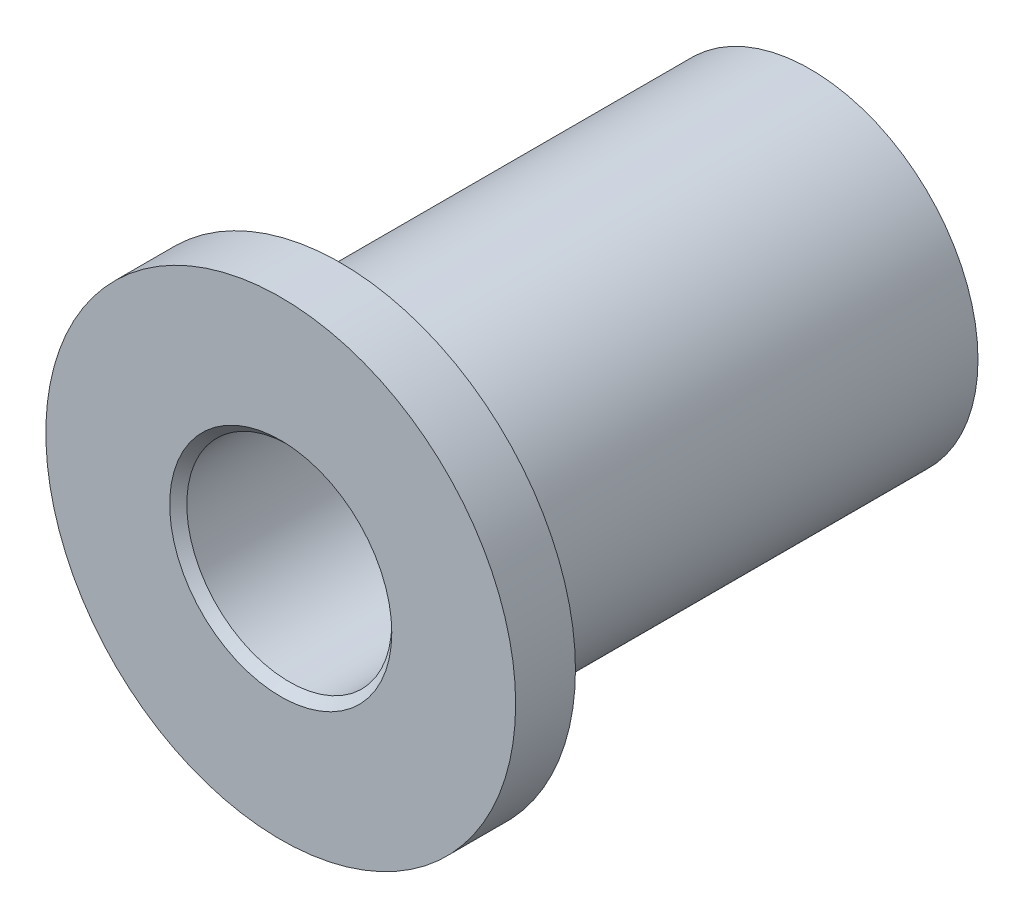
ISO-10303-21;
HEADER;
FILE_DESCRIPTION(('STEP AP214'),'2;1');
FILE_NAME('part.step','',(''),(''),'','','');
FILE_SCHEMA(('AUTOMOTIVE_DESIGN { 1 0 10303 214 1 1 1 1 }'));
ENDSEC;
DATA;
#1=APPLICATION_CONTEXT('core data for automotive mechanical design processes');
#2=APPLICATION_PROTOCOL_DEFINITION('international standard','automotive_design',2000,#1);
#3=PRODUCT_CONTEXT('',#1,'mechanical');
#4=PRODUCT('Part','Part','',(#3));
#5=PRODUCT_RELATED_PRODUCT_CATEGORY('part','',(#4));
#6=PRODUCT_DEFINITION_FORMATION('','',#4);
#7=PRODUCT_DEFINITION_CONTEXT('part definition',#1,'design');
#8=PRODUCT_DEFINITION('design','',#6,#7);
#9=PRODUCT_DEFINITION_SHAPE('','',#8);
#10=(LENGTH_UNIT() NAMED_UNIT(*) SI_UNIT(.MILLI.,.METRE.));
#11=(NAMED_UNIT(*) PLANE_ANGLE_UNIT() SI_UNIT($,.RADIAN.));
#12=(NAMED_UNIT(*) SI_UNIT($,.STERADIAN.) SOLID_ANGLE_UNIT());
#13=UNCERTAINTY_MEASURE_WITH_UNIT(LENGTH_MEASURE(1.E-05),#10,'distance_accuracy_value','');
#14=(GEOMETRIC_REPRESENTATION_CONTEXT(3) GLOBAL_UNCERTAINTY_ASSIGNED_CONTEXT((#13)) GLOBAL_UNIT_ASSIGNED_CONTEXT((#10,
#11,#12)) REPRESENTATION_CONTEXT('',''));
#15=CARTESIAN_POINT('',(0.,0.,0.));
#16=DIRECTION('',(0.,0.,1.));
#17=DIRECTION('',(1.,0.,0.));
#18=AXIS2_PLACEMENT_3D('',#15,#16,#17);
#19=CARTESIAN_POINT('',(0.,0.,-1.4));
#20=DIRECTION('',(0.,0.,1.));
#21=DIRECTION('',(1.,0.,0.));
#22=AXIS2_PLACEMENT_3D('',#19,#20,#21);
#23=PLANE('',#22);
#24=CARTESIAN_POINT('',(0.,0.,-1.4));
#25=DIRECTION('',(0.,0.,1.));
#26=DIRECTION('',(1.,0.,0.));
#27=AXIS2_PLACEMENT_3D('',#24,#25,#26);
#28=CIRCLE('',#27,5.5);
#29=CARTESIAN_POINT('',(5.5,0.,-1.4));
#30=VERTEX_POINT('',#29);
#31=EDGE_CURVE('E47',#30,#30,#28,.T.);
#32=ORIENTED_EDGE('',*,*,#31,.F.);
#33=EDGE_LOOP('',(#32));
#34=FACE_BOUND('',#33,.T.);
#35=CARTESIAN_POINT('',(0.,0.,-1.4));
#36=DIRECTION('',(0.,0.,1.));
#37=DIRECTION('',(1.,0.,0.));
#38=AXIS2_PLACEMENT_3D('',#35,#36,#37);
#39=CIRCLE('',#38,3.925);
#40=CARTESIAN_POINT('',(3.925,0.,-1.4));
#41=VERTEX_POINT('',#40);
#42=EDGE_CURVE('E43',#41,#41,#39,.F.);
#43=ORIENTED_EDGE('',*,*,#42,.F.);
#44=EDGE_LOOP('',(#43));
#45=FACE_BOUND('',#44,.T.);
#46=ADVANCED_FACE('F32',(#34,#45),#23,.F.);
#47=CARTESIAN_POINT('',(0.,0.,-1.4));
#48=DIRECTION('',(0.,0.,1.));
#49=DIRECTION('',(1.,0.,0.));
#50=AXIS2_PLACEMENT_3D('',#47,#48,#49);
#51=CYLINDRICAL_SURFACE('',#50,5.5);
#52=ORIENTED_EDGE('',*,*,#31,.T.);
#53=EDGE_LOOP('',(#52));
#54=FACE_BOUND('',#53,.T.);
#55=CARTESIAN_POINT('',(0.,0.,0.));
#56=DIRECTION('',(0.,0.,1.));
#57=DIRECTION('',(1.,0.,0.));
#58=AXIS2_PLACEMENT_3D('',#55,#56,#57);
#59=CIRCLE('',#58,5.5);
#60=CARTESIAN_POINT('',(5.5,0.,0.));
#61=VERTEX_POINT('',#60);
#62=EDGE_CURVE('E50',#61,#61,#59,.T.);
#63=ORIENTED_EDGE('',*,*,#62,.F.);
#64=EDGE_LOOP('',(#63));
#65=FACE_BOUND('',#64,.T.);
#66=ADVANCED_FACE('F76',(#54,#65),#51,.T.);
#67=CARTESIAN_POINT('',(0.,0.,0.));
#68=DIRECTION('',(0.,0.,1.));
#69=DIRECTION('',(1.,0.,0.));
#70=AXIS2_PLACEMENT_3D('',#67,#68,#69);
#71=PLANE('',#70);
#72=CARTESIAN_POINT('',(0.,0.,0.));
#73=DIRECTION('',(0.,0.,1.));
#74=DIRECTION('',(1.,0.,0.));
#75=AXIS2_PLACEMENT_3D('',#72,#73,#74);
#76=CIRCLE('',#75,2.60000000000001);
#77=CARTESIAN_POINT('',(2.60000000000001,0.,0.));
#78=VERTEX_POINT('',#77);
#79=EDGE_CURVE('E10',#78,#78,#76,.F.);
#80=ORIENTED_EDGE('',*,*,#79,.T.);
#81=EDGE_LOOP('',(#80));
#82=FACE_BOUND('',#81,.T.);
#83=ORIENTED_EDGE('',*,*,#62,.T.);
#84=EDGE_LOOP('',(#83));
#85=FACE_BOUND('',#84,.T.);
#86=ADVANCED_FACE('F82',(#82,#85),#71,.T.);
#87=CARTESIAN_POINT('',(0.,0.,-12.4));
#88=DIRECTION('',(0.,0.,1.));
#89=DIRECTION('',(1.,0.,0.));
#90=AXIS2_PLACEMENT_3D('',#87,#88,#89);
#91=CYLINDRICAL_SURFACE('',#90,3.925);
#92=CARTESIAN_POINT('',(0.,0.,-12.4));
#93=DIRECTION('',(0.,0.,-1.));
#94=DIRECTION('',(-1.,0.,0.));
#95=AXIS2_PLACEMENT_3D('',#92,#93,#94);
#96=CIRCLE('',#95,3.925);
#97=CARTESIAN_POINT('',(-3.925,0.,-12.4));
#98=VERTEX_POINT('',#97);
#99=EDGE_CURVE('E53',#98,#98,#96,.T.);
#100=ORIENTED_EDGE('',*,*,#99,.F.);
#101=EDGE_LOOP('',(#100));
#102=FACE_BOUND('',#101,.T.);
#103=ORIENTED_EDGE('',*,*,#42,.T.);
#104=EDGE_LOOP('',(#103));
#105=FACE_BOUND('',#104,.T.);
#106=ADVANCED_FACE('F73',(#102,#105),#91,.T.);
#107=CARTESIAN_POINT('',(0.,0.,-12.4));
#108=DIRECTION('',(0.,0.,-1.));
#109=DIRECTION('',(-1.,0.,0.));
#110=AXIS2_PLACEMENT_3D('',#107,#108,#109);
#111=PLANE('',#110);
#112=CARTESIAN_POINT('',(0.,0.,-12.4));
#113=DIRECTION('',(0.,0.,1.));
#114=DIRECTION('',(1.,0.,0.));
#115=AXIS2_PLACEMENT_3D('',#112,#113,#114);
#116=CIRCLE('',#115,2.4);
#117=CARTESIAN_POINT('',(2.4,0.,-12.4));
#118=VERTEX_POINT('',#117);
#119=EDGE_CURVE('E58',#118,#118,#116,.T.);
#120=ORIENTED_EDGE('',*,*,#119,.T.);
#121=EDGE_LOOP('',(#120));
#122=FACE_BOUND('',#121,.T.);
#123=ORIENTED_EDGE('',*,*,#99,.T.);
#124=EDGE_LOOP('',(#123));
#125=FACE_BOUND('',#124,.T.);
#126=ADVANCED_FACE('F62',(#122,#125),#111,.T.);
#127=CARTESIAN_POINT('',(0.,0.,-12.4));
#128=DIRECTION('',(0.,0.,1.));
#129=DIRECTION('',(1.,0.,0.));
#130=AXIS2_PLACEMENT_3D('',#127,#128,#129);
#131=CYLINDRICAL_SURFACE('',#130,2.4);
#132=CARTESIAN_POINT('',(0.,0.,-0.200000000000013));
#133=DIRECTION('',(0.,0.,1.));
#134=DIRECTION('',(1.,0.,0.));
#135=AXIS2_PLACEMENT_3D('',#132,#133,#134);
#136=CIRCLE('',#135,2.4);
#137=CARTESIAN_POINT('',(2.4,0.,-0.200000000000013));
#138=VERTEX_POINT('',#137);
#139=EDGE_CURVE('E39',#138,#138,#136,.T.);
#140=ORIENTED_EDGE('',*,*,#139,.T.);
#141=EDGE_LOOP('',(#140));
#142=FACE_BOUND('',#141,.T.);
#143=ORIENTED_EDGE('',*,*,#119,.F.);
#144=EDGE_LOOP('',(#143));
#145=FACE_BOUND('',#144,.T.);
#146=ADVANCED_FACE('F65',(#142,#145),#131,.F.);
#147=CARTESIAN_POINT('',(0.,0.,-0.200000000000013));
#148=DIRECTION('',(0.,0.,1.));
#149=DIRECTION('',(1.,0.,0.));
#150=AXIS2_PLACEMENT_3D('',#147,#148,#149);
#151=CONICAL_SURFACE('',#150,2.4,0.78539816339745);
#152=ORIENTED_EDGE('',*,*,#79,.F.);
#153=EDGE_LOOP('',(#152));
#154=FACE_BOUND('',#153,.T.);
#155=ORIENTED_EDGE('',*,*,#139,.F.);
#156=EDGE_LOOP('',(#155));
#157=FACE_BOUND('',#156,.T.);
#158=ADVANCED_FACE('F34',(#154,#157),#151,.F.);
#159=CLOSED_SHELL('',(#46,#66,#86,#106,#126,#146,#158));
#160=MANIFOLD_SOLID_BREP('B2',#159);
#161=ADVANCED_BREP_SHAPE_REPRESENTATION('',(#18,#160),#14);
#162=SHAPE_DEFINITION_REPRESENTATION(#9,#161);
ENDSEC;
END-ISO-10303-21;
